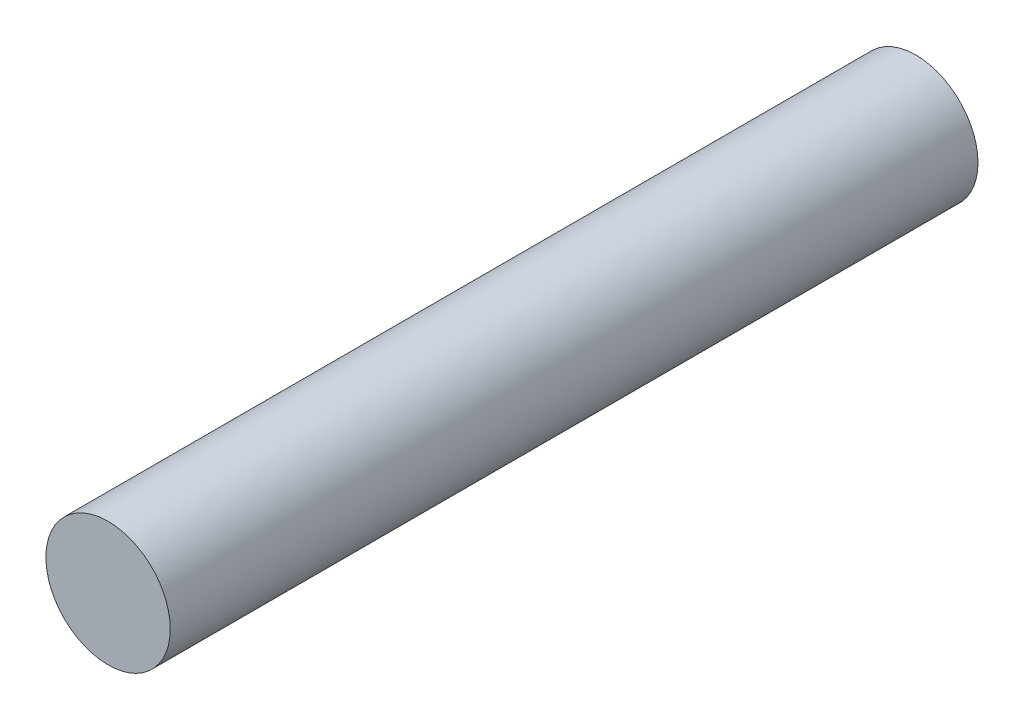
ISO-10303-21;
HEADER;
FILE_DESCRIPTION(('STEP AP214'),'2;1');
FILE_NAME('part.step','',(''),(''),'','','');
FILE_SCHEMA(('AUTOMOTIVE_DESIGN { 1 0 10303 214 1 1 1 1 }'));
ENDSEC;
DATA;
#1=APPLICATION_CONTEXT('core data for automotive mechanical design processes');
#2=APPLICATION_PROTOCOL_DEFINITION('international standard','automotive_design',2000,#1);
#3=PRODUCT_CONTEXT('',#1,'mechanical');
#4=PRODUCT('Part','Part','',(#3));
#5=PRODUCT_RELATED_PRODUCT_CATEGORY('part','',(#4));
#6=PRODUCT_DEFINITION_FORMATION('','',#4);
#7=PRODUCT_DEFINITION_CONTEXT('part definition',#1,'design');
#8=PRODUCT_DEFINITION('design','',#6,#7);
#9=PRODUCT_DEFINITION_SHAPE('','',#8);
#10=(LENGTH_UNIT() NAMED_UNIT(*) SI_UNIT(.MILLI.,.METRE.));
#11=(NAMED_UNIT(*) PLANE_ANGLE_UNIT() SI_UNIT($,.RADIAN.));
#12=(NAMED_UNIT(*) SI_UNIT($,.STERADIAN.) SOLID_ANGLE_UNIT());
#13=UNCERTAINTY_MEASURE_WITH_UNIT(LENGTH_MEASURE(1.E-05),#10,'distance_accuracy_value','');
#14=(GEOMETRIC_REPRESENTATION_CONTEXT(3) GLOBAL_UNCERTAINTY_ASSIGNED_CONTEXT((#13)) GLOBAL_UNIT_ASSIGNED_CONTEXT((#10,
#11,#12)) REPRESENTATION_CONTEXT('',''));
#15=CARTESIAN_POINT('',(0.,0.,0.));
#16=DIRECTION('',(0.,0.,1.));
#17=DIRECTION('',(1.,0.,0.));
#18=AXIS2_PLACEMENT_3D('',#15,#16,#17);
#19=CARTESIAN_POINT('',(0.,0.,14.6812));
#20=DIRECTION('',(0.,0.,-1.));
#21=DIRECTION('',(-1.,0.,0.));
#22=AXIS2_PLACEMENT_3D('',#19,#20,#21);
#23=CYLINDRICAL_SURFACE('',#22,1.1303);
#24=CARTESIAN_POINT('',(0.,0.,14.6812));
#25=DIRECTION('',(0.,0.,1.));
#26=DIRECTION('',(1.,0.,0.));
#27=AXIS2_PLACEMENT_3D('',#24,#25,#26);
#28=CIRCLE('',#27,1.1303);
#29=CARTESIAN_POINT('',(1.1303,0.,14.6812));
#30=VERTEX_POINT('',#29);
#31=EDGE_CURVE('E10',#30,#30,#28,.T.);
#32=ORIENTED_EDGE('',*,*,#31,.F.);
#33=EDGE_LOOP('',(#32));
#34=FACE_BOUND('',#33,.T.);
#35=CARTESIAN_POINT('',(0.,0.,0.));
#36=DIRECTION('',(0.,0.,1.));
#37=DIRECTION('',(1.,0.,0.));
#38=AXIS2_PLACEMENT_3D('',#35,#36,#37);
#39=CIRCLE('',#38,1.1303);
#40=CARTESIAN_POINT('',(1.1303,0.,0.));
#41=VERTEX_POINT('',#40);
#42=EDGE_CURVE('E35',#41,#41,#39,.T.);
#43=ORIENTED_EDGE('',*,*,#42,.T.);
#44=EDGE_LOOP('',(#43));
#45=FACE_BOUND('',#44,.T.);
#46=ADVANCED_FACE('F32',(#34,#45),#23,.T.);
#47=CARTESIAN_POINT('',(0.,0.,14.6812));
#48=DIRECTION('',(0.,0.,1.));
#49=DIRECTION('',(1.,0.,0.));
#50=AXIS2_PLACEMENT_3D('',#47,#48,#49);
#51=PLANE('',#50);
#52=ORIENTED_EDGE('',*,*,#31,.T.);
#53=EDGE_LOOP('',(#52));
#54=FACE_BOUND('',#53,.T.);
#55=ADVANCED_FACE('F47',(#54),#51,.T.);
#56=CARTESIAN_POINT('',(0.,0.,0.));
#57=DIRECTION('',(0.,0.,1.));
#58=DIRECTION('',(1.,0.,0.));
#59=AXIS2_PLACEMENT_3D('',#56,#57,#58);
#60=PLANE('',#59);
#61=ORIENTED_EDGE('',*,*,#42,.F.);
#62=EDGE_LOOP('',(#61));
#63=FACE_BOUND('',#62,.T.);
#64=ADVANCED_FACE('F45',(#63),#60,.F.);
#65=CLOSED_SHELL('',(#46,#55,#64));
#66=MANIFOLD_SOLID_BREP('B2',#65);
#67=ADVANCED_BREP_SHAPE_REPRESENTATION('',(#18,#66),#14);
#68=SHAPE_DEFINITION_REPRESENTATION(#9,#67);
ENDSEC;
END-ISO-10303-21;
